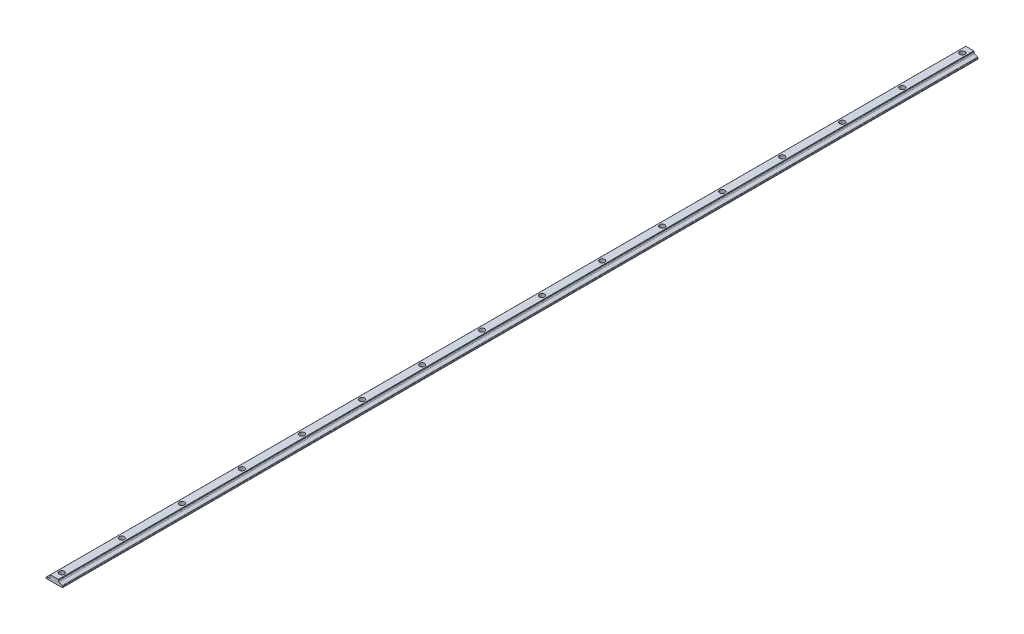
ISO-10303-21;
HEADER;
FILE_DESCRIPTION(('STEP AP214'),'2;1');
FILE_NAME('part.step','',(''),(''),'','','');
FILE_SCHEMA(('AUTOMOTIVE_DESIGN { 1 0 10303 214 1 1 1 1 }'));
ENDSEC;
DATA;
#1=APPLICATION_CONTEXT('core data for automotive mechanical design processes');
#2=APPLICATION_PROTOCOL_DEFINITION('international standard','automotive_design',2000,#1);
#3=PRODUCT_CONTEXT('',#1,'mechanical');
#4=PRODUCT('Part','Part','',(#3));
#5=PRODUCT_RELATED_PRODUCT_CATEGORY('part','',(#4));
#6=PRODUCT_DEFINITION_FORMATION('','',#4);
#7=PRODUCT_DEFINITION_CONTEXT('part definition',#1,'design');
#8=PRODUCT_DEFINITION('design','',#6,#7);
#9=PRODUCT_DEFINITION_SHAPE('','',#8);
#10=(LENGTH_UNIT() NAMED_UNIT(*) SI_UNIT(.MILLI.,.METRE.));
#11=(NAMED_UNIT(*) PLANE_ANGLE_UNIT() SI_UNIT($,.RADIAN.));
#12=(NAMED_UNIT(*) SI_UNIT($,.STERADIAN.) SOLID_ANGLE_UNIT());
#13=UNCERTAINTY_MEASURE_WITH_UNIT(LENGTH_MEASURE(1.E-05),#10,'distance_accuracy_value','');
#14=(GEOMETRIC_REPRESENTATION_CONTEXT(3) GLOBAL_UNCERTAINTY_ASSIGNED_CONTEXT((#13)) GLOBAL_UNIT_ASSIGNED_CONTEXT((#10,
#11,#12)) REPRESENTATION_CONTEXT('',''));
#15=CARTESIAN_POINT('',(0.,0.,0.));
#16=DIRECTION('',(0.,0.,1.));
#17=DIRECTION('',(1.,0.,0.));
#18=AXIS2_PLACEMENT_3D('',#15,#16,#17);
#19=CARTESIAN_POINT('',(5.43940049720106,-2.343999689794,387.35));
#20=DIRECTION('',(0.,0.,-1.));
#21=DIRECTION('',(-1.,0.,0.));
#22=AXIS2_PLACEMENT_3D('',#19,#20,#21);
#23=CYLINDRICAL_SURFACE('',#22,0.990000709201032);
#24=CARTESIAN_POINT('',(5.43940049720106,-2.343999689794,-387.35));
#25=DIRECTION('',(0.,0.,-1.));
#26=DIRECTION('',(1.,0.,0.));
#27=AXIS2_PLACEMENT_3D('',#24,#25,#26);
#28=CIRCLE('',#27,0.990000709201032);
#29=CARTESIAN_POINT('',(5.04570230438704,-3.25235156940537,-387.35));
#30=VERTEX_POINT('',#29);
#31=CARTESIAN_POINT('',(4.44939978800002,-2.343999689794,-387.35));
#32=VERTEX_POINT('',#31);
#33=EDGE_CURVE('E179',#30,#32,#28,.T.);
#34=ORIENTED_EDGE('',*,*,#33,.T.);
#35=DIRECTION('',(0.,0.,-1.));
#36=VECTOR('',#35,1.);
#37=CARTESIAN_POINT('',(4.44939978800002,-2.343999689794,387.35));
#38=LINE('',#37,#36);
#39=CARTESIAN_POINT('',(4.44939978800002,-2.343999689794,387.35));
#40=VERTEX_POINT('',#39);
#41=EDGE_CURVE('E247',#40,#32,#38,.T.);
#42=ORIENTED_EDGE('',*,*,#41,.F.);
#43=CARTESIAN_POINT('',(5.43940049720106,-2.343999689794,387.35));
#44=DIRECTION('',(0.,0.,-1.));
#45=DIRECTION('',(1.,0.,0.));
#46=AXIS2_PLACEMENT_3D('',#43,#44,#45);
#47=CIRCLE('',#46,0.990000709201032);
#48=CARTESIAN_POINT('',(5.04570230438704,-3.25235156940537,387.35));
#49=VERTEX_POINT('',#48);
#50=EDGE_CURVE('E210',#49,#40,#47,.T.);
#51=ORIENTED_EDGE('',*,*,#50,.F.);
#52=DIRECTION('',(0.,0.,-1.));
#53=VECTOR('',#52,1.);
#54=CARTESIAN_POINT('',(5.04570230438704,-3.25235156940537,387.35));
#55=LINE('',#54,#53);
#56=EDGE_CURVE('E175',#49,#30,#55,.T.);
#57=ORIENTED_EDGE('',*,*,#56,.T.);
#58=EDGE_LOOP('',(#34,#42,#51,#57));
#59=FACE_BOUND('',#58,.T.);
#60=ADVANCED_FACE('F33',(#59),#23,.F.);
#61=CARTESIAN_POINT('',(4.44939978800002,-2.343999689794,387.35));
#62=DIRECTION('',(-1.,0.,0.));
#63=DIRECTION('',(0.,-1.,0.));
#64=AXIS2_PLACEMENT_3D('',#61,#62,#63);
#65=PLANE('',#64);
#66=DIRECTION('',(0.,1.,0.));
#67=VECTOR('',#66,1.);
#68=CARTESIAN_POINT('',(4.44939978800002,-2.343999689794,-387.35));
#69=LINE('',#68,#67);
#70=CARTESIAN_POINT('',(4.44939978800002,-1.65400001896344,-387.35));
#71=VERTEX_POINT('',#70);
#72=EDGE_CURVE('E182',#32,#71,#69,.T.);
#73=ORIENTED_EDGE('',*,*,#72,.T.);
#74=DIRECTION('',(0.,0.,-1.));
#75=VECTOR('',#74,1.);
#76=CARTESIAN_POINT('',(4.44939978800002,-1.65400001896344,387.35));
#77=LINE('',#76,#75);
#78=CARTESIAN_POINT('',(4.44939978800002,-1.65400001896344,387.35));
#79=VERTEX_POINT('',#78);
#80=EDGE_CURVE('E244',#79,#71,#77,.T.);
#81=ORIENTED_EDGE('',*,*,#80,.F.);
#82=DIRECTION('',(0.,1.,0.));
#83=VECTOR('',#82,1.);
#84=CARTESIAN_POINT('',(4.44939978800002,-2.343999689794,387.35));
#85=LINE('',#84,#83);
#86=EDGE_CURVE('E118',#40,#79,#85,.T.);
#87=ORIENTED_EDGE('',*,*,#86,.F.);
#88=ORIENTED_EDGE('',*,*,#41,.T.);
#89=EDGE_LOOP('',(#73,#81,#87,#88));
#90=FACE_BOUND('',#89,.T.);
#91=ADVANCED_FACE('F349',(#90),#65,.F.);
#92=CARTESIAN_POINT('',(4.31939976903661,-1.65400001896344,387.35));
#93=DIRECTION('',(0.,0.,-1.));
#94=DIRECTION('',(-1.,0.,0.));
#95=AXIS2_PLACEMENT_3D('',#92,#93,#94);
#96=CYLINDRICAL_SURFACE('',#95,0.1300000189634);
#97=CARTESIAN_POINT('',(4.31939976903661,-1.65400001896344,-387.35));
#98=DIRECTION('',(0.,0.,1.));
#99=DIRECTION('',(1.,0.,0.));
#100=AXIS2_PLACEMENT_3D('',#97,#98,#99);
#101=CIRCLE('',#100,0.1300000189634);
#102=CARTESIAN_POINT('',(4.31939976903661,-1.52400000000004,-387.35));
#103=VERTEX_POINT('',#102);
#104=EDGE_CURVE('E185',#71,#103,#101,.T.);
#105=ORIENTED_EDGE('',*,*,#104,.T.);
#106=DIRECTION('',(0.,0.,-1.));
#107=VECTOR('',#106,1.);
#108=CARTESIAN_POINT('',(4.31939976903661,-1.52400000000004,387.35));
#109=LINE('',#108,#107);
#110=CARTESIAN_POINT('',(4.31939976903661,-1.52400000000004,387.35));
#111=VERTEX_POINT('',#110);
#112=EDGE_CURVE('E241',#111,#103,#109,.T.);
#113=ORIENTED_EDGE('',*,*,#112,.F.);
#114=CARTESIAN_POINT('',(4.31939976903661,-1.65400001896344,387.35));
#115=DIRECTION('',(0.,0.,1.));
#116=DIRECTION('',(1.,0.,0.));
#117=AXIS2_PLACEMENT_3D('',#114,#115,#116);
#118=CIRCLE('',#117,0.1300000189634);
#119=EDGE_CURVE('E666',#79,#111,#118,.T.);
#120=ORIENTED_EDGE('',*,*,#119,.F.);
#121=ORIENTED_EDGE('',*,*,#80,.T.);
#122=EDGE_LOOP('',(#105,#113,#120,#121));
#123=FACE_BOUND('',#122,.T.);
#124=ADVANCED_FACE('F339',(#123),#96,.T.);
#125=CARTESIAN_POINT('',(4.31939976903661,-1.52400000000004,387.35));
#126=DIRECTION('',(0.,-1.,0.));
#127=DIRECTION('',(1.,0.,0.));
#128=AXIS2_PLACEMENT_3D('',#125,#126,#127);
#129=PLANE('',#128);
#130=CARTESIAN_POINT('',(0.965200000000012,-1.52400000000003,330.2));
#131=DIRECTION('',(0.,1.,0.));
#132=DIRECTION('',(-1.,0.,0.));
#133=AXIS2_PLACEMENT_3D('',#130,#131,#132);
#134=CIRCLE('',#133,2.18440000000002);
#135=CARTESIAN_POINT('',(-1.21920000000001,-1.52400000000002,330.2));
#136=VERTEX_POINT('',#135);
#137=EDGE_CURVE('E655',#136,#136,#134,.T.);
#138=ORIENTED_EDGE('',*,*,#137,.F.);
#139=EDGE_LOOP('',(#138));
#140=FACE_BOUND('',#139,.T.);
#141=CARTESIAN_POINT('',(0.965200000000012,-1.52400000000003,381.));
#142=DIRECTION('',(0.,1.,0.));
#143=DIRECTION('',(-1.,0.,0.));
#144=AXIS2_PLACEMENT_3D('',#141,#142,#143);
#145=CIRCLE('',#144,2.18440000000002);
#146=CARTESIAN_POINT('',(-1.21920000000001,-1.52400000000002,381.));
#147=VERTEX_POINT('',#146);
#148=EDGE_CURVE('E656',#147,#147,#145,.T.);
#149=ORIENTED_EDGE('',*,*,#148,.F.);
#150=EDGE_LOOP('',(#149));
#151=FACE_BOUND('',#150,.T.);
#152=DIRECTION('',(-1.,0.,0.));
#153=VECTOR('',#152,1.);
#154=CARTESIAN_POINT('',(4.31939976903661,-1.52400000000004,-387.35));
#155=LINE('',#154,#153);
#156=CARTESIAN_POINT('',(-2.38060024303659,-1.52400000000001,-387.35));
#157=VERTEX_POINT('',#156);
#158=EDGE_CURVE('E187',#103,#157,#155,.T.);
#159=ORIENTED_EDGE('',*,*,#158,.T.);
#160=DIRECTION('',(0.,0.,-1.));
#161=VECTOR('',#160,1.);
#162=CARTESIAN_POINT('',(-2.38060024303659,-1.52400000000001,387.35));
#163=LINE('',#162,#161);
#164=CARTESIAN_POINT('',(-2.38060024303659,-1.52400000000001,387.35));
#165=VERTEX_POINT('',#164);
#166=EDGE_CURVE('E238',#165,#157,#163,.T.);
#167=ORIENTED_EDGE('',*,*,#166,.F.);
#168=DIRECTION('',(-1.,0.,0.));
#169=VECTOR('',#168,1.);
#170=CARTESIAN_POINT('',(4.31939976903661,-1.52400000000004,387.35));
#171=LINE('',#170,#169);
#172=EDGE_CURVE('E668',#111,#165,#171,.T.);
#173=ORIENTED_EDGE('',*,*,#172,.F.);
#174=ORIENTED_EDGE('',*,*,#112,.T.);
#175=EDGE_LOOP('',(#159,#167,#173,#174));
#176=FACE_BOUND('',#175,.T.);
#177=CARTESIAN_POINT('',(0.965200000000012,-1.52400000000003,279.4));
#178=DIRECTION('',(0.,1.,0.));
#179=DIRECTION('',(-1.,0.,0.));
#180=AXIS2_PLACEMENT_3D('',#177,#178,#179);
#181=CIRCLE('',#180,2.18440000000002);
#182=CARTESIAN_POINT('',(-1.21920000000001,-1.52400000000002,279.4));
#183=VERTEX_POINT('',#182);
#184=EDGE_CURVE('E252',#183,#183,#181,.T.);
#185=ORIENTED_EDGE('',*,*,#184,.F.);
#186=EDGE_LOOP('',(#185));
#187=FACE_BOUND('',#186,.T.);
#188=CARTESIAN_POINT('',(0.965200000000012,-1.52400000000003,228.6));
#189=DIRECTION('',(0.,1.,0.));
#190=DIRECTION('',(-1.,0.,0.));
#191=AXIS2_PLACEMENT_3D('',#188,#189,#190);
#192=CIRCLE('',#191,2.18440000000002);
#193=CARTESIAN_POINT('',(-1.21920000000001,-1.52400000000002,228.6));
#194=VERTEX_POINT('',#193);
#195=EDGE_CURVE('E258',#194,#194,#192,.T.);
#196=ORIENTED_EDGE('',*,*,#195,.F.);
#197=EDGE_LOOP('',(#196));
#198=FACE_BOUND('',#197,.T.);
#199=CARTESIAN_POINT('',(0.965200000000012,-1.52400000000003,177.8));
#200=DIRECTION('',(0.,1.,0.));
#201=DIRECTION('',(-1.,0.,0.));
#202=AXIS2_PLACEMENT_3D('',#199,#200,#201);
#203=CIRCLE('',#202,2.18440000000002);
#204=CARTESIAN_POINT('',(-1.21920000000001,-1.52400000000002,177.8));
#205=VERTEX_POINT('',#204);
#206=EDGE_CURVE('E264',#205,#205,#203,.T.);
#207=ORIENTED_EDGE('',*,*,#206,.F.);
#208=EDGE_LOOP('',(#207));
#209=FACE_BOUND('',#208,.T.);
#210=CARTESIAN_POINT('',(0.965200000000012,-1.52400000000003,127.));
#211=DIRECTION('',(0.,1.,0.));
#212=DIRECTION('',(-1.,0.,0.));
#213=AXIS2_PLACEMENT_3D('',#210,#211,#212);
#214=CIRCLE('',#213,2.18440000000002);
#215=CARTESIAN_POINT('',(-1.21920000000001,-1.52400000000002,127.));
#216=VERTEX_POINT('',#215);
#217=EDGE_CURVE('E270',#216,#216,#214,.T.);
#218=ORIENTED_EDGE('',*,*,#217,.F.);
#219=EDGE_LOOP('',(#218));
#220=FACE_BOUND('',#219,.T.);
#221=CARTESIAN_POINT('',(0.965200000000012,-1.52400000000003,76.2));
#222=DIRECTION('',(0.,1.,0.));
#223=DIRECTION('',(-1.,0.,0.));
#224=AXIS2_PLACEMENT_3D('',#221,#222,#223);
#225=CIRCLE('',#224,2.18440000000002);
#226=CARTESIAN_POINT('',(-1.21920000000001,-1.52400000000002,76.2));
#227=VERTEX_POINT('',#226);
#228=EDGE_CURVE('E276',#227,#227,#225,.T.);
#229=ORIENTED_EDGE('',*,*,#228,.F.);
#230=EDGE_LOOP('',(#229));
#231=FACE_BOUND('',#230,.T.);
#232=CARTESIAN_POINT('',(0.965200000000012,-1.52400000000003,25.4));
#233=DIRECTION('',(0.,1.,0.));
#234=DIRECTION('',(-1.,0.,0.));
#235=AXIS2_PLACEMENT_3D('',#232,#233,#234);
#236=CIRCLE('',#235,2.18440000000002);
#237=CARTESIAN_POINT('',(-1.21920000000001,-1.52400000000002,25.4));
#238=VERTEX_POINT('',#237);
#239=EDGE_CURVE('E282',#238,#238,#236,.T.);
#240=ORIENTED_EDGE('',*,*,#239,.F.);
#241=EDGE_LOOP('',(#240));
#242=FACE_BOUND('',#241,.T.);
#243=CARTESIAN_POINT('',(0.965200000000012,-1.52400000000003,-25.4));
#244=DIRECTION('',(0.,1.,0.));
#245=DIRECTION('',(-1.,0.,0.));
#246=AXIS2_PLACEMENT_3D('',#243,#244,#245);
#247=CIRCLE('',#246,2.18440000000002);
#248=CARTESIAN_POINT('',(-1.21920000000001,-1.52400000000002,-25.4));
#249=VERTEX_POINT('',#248);
#250=EDGE_CURVE('E288',#249,#249,#247,.T.);
#251=ORIENTED_EDGE('',*,*,#250,.F.);
#252=EDGE_LOOP('',(#251));
#253=FACE_BOUND('',#252,.T.);
#254=CARTESIAN_POINT('',(0.965200000000012,-1.52400000000003,-76.2));
#255=DIRECTION('',(0.,1.,0.));
#256=DIRECTION('',(-1.,0.,0.));
#257=AXIS2_PLACEMENT_3D('',#254,#255,#256);
#258=CIRCLE('',#257,2.18440000000002);
#259=CARTESIAN_POINT('',(-1.21920000000001,-1.52400000000002,-76.2));
#260=VERTEX_POINT('',#259);
#261=EDGE_CURVE('E294',#260,#260,#258,.T.);
#262=ORIENTED_EDGE('',*,*,#261,.F.);
#263=EDGE_LOOP('',(#262));
#264=FACE_BOUND('',#263,.T.);
#265=CARTESIAN_POINT('',(0.965200000000012,-1.52400000000003,-127.));
#266=DIRECTION('',(0.,1.,0.));
#267=DIRECTION('',(-1.,0.,0.));
#268=AXIS2_PLACEMENT_3D('',#265,#266,#267);
#269=CIRCLE('',#268,2.18440000000002);
#270=CARTESIAN_POINT('',(-1.21920000000001,-1.52400000000002,-127.));
#271=VERTEX_POINT('',#270);
#272=EDGE_CURVE('E300',#271,#271,#269,.T.);
#273=ORIENTED_EDGE('',*,*,#272,.F.);
#274=EDGE_LOOP('',(#273));
#275=FACE_BOUND('',#274,.T.);
#276=CARTESIAN_POINT('',(0.965200000000012,-1.52400000000003,-177.8));
#277=DIRECTION('',(0.,1.,0.));
#278=DIRECTION('',(-1.,0.,0.));
#279=AXIS2_PLACEMENT_3D('',#276,#277,#278);
#280=CIRCLE('',#279,2.18440000000002);
#281=CARTESIAN_POINT('',(-1.21920000000001,-1.52400000000002,-177.8));
#282=VERTEX_POINT('',#281);
#283=EDGE_CURVE('E306',#282,#282,#280,.T.);
#284=ORIENTED_EDGE('',*,*,#283,.F.);
#285=EDGE_LOOP('',(#284));
#286=FACE_BOUND('',#285,.T.);
#287=CARTESIAN_POINT('',(0.965200000000012,-1.52400000000003,-228.6));
#288=DIRECTION('',(0.,1.,0.));
#289=DIRECTION('',(-1.,0.,0.));
#290=AXIS2_PLACEMENT_3D('',#287,#288,#289);
#291=CIRCLE('',#290,2.18440000000002);
#292=CARTESIAN_POINT('',(-1.21920000000001,-1.52400000000002,-228.6));
#293=VERTEX_POINT('',#292);
#294=EDGE_CURVE('E312',#293,#293,#291,.T.);
#295=ORIENTED_EDGE('',*,*,#294,.F.);
#296=EDGE_LOOP('',(#295));
#297=FACE_BOUND('',#296,.T.);
#298=CARTESIAN_POINT('',(0.965200000000012,-1.52400000000003,-279.4));
#299=DIRECTION('',(0.,1.,0.));
#300=DIRECTION('',(-1.,0.,0.));
#301=AXIS2_PLACEMENT_3D('',#298,#299,#300);
#302=CIRCLE('',#301,2.18440000000002);
#303=CARTESIAN_POINT('',(-1.21920000000001,-1.52400000000002,-279.4));
#304=VERTEX_POINT('',#303);
#305=EDGE_CURVE('E318',#304,#304,#302,.T.);
#306=ORIENTED_EDGE('',*,*,#305,.F.);
#307=EDGE_LOOP('',(#306));
#308=FACE_BOUND('',#307,.T.);
#309=CARTESIAN_POINT('',(0.965200000000012,-1.52400000000003,-330.2));
#310=DIRECTION('',(0.,1.,0.));
#311=DIRECTION('',(-1.,0.,0.));
#312=AXIS2_PLACEMENT_3D('',#309,#310,#311);
#313=CIRCLE('',#312,2.18440000000002);
#314=CARTESIAN_POINT('',(-1.21920000000001,-1.52400000000002,-330.2));
#315=VERTEX_POINT('',#314);
#316=EDGE_CURVE('E324',#315,#315,#313,.T.);
#317=ORIENTED_EDGE('',*,*,#316,.F.);
#318=EDGE_LOOP('',(#317));
#319=FACE_BOUND('',#318,.T.);
#320=CARTESIAN_POINT('',(0.965200000000012,-1.52400000000003,-381.));
#321=DIRECTION('',(0.,1.,0.));
#322=DIRECTION('',(-1.,0.,0.));
#323=AXIS2_PLACEMENT_3D('',#320,#321,#322);
#324=CIRCLE('',#323,2.18440000000002);
#325=CARTESIAN_POINT('',(-1.21920000000001,-1.52400000000002,-381.));
#326=VERTEX_POINT('',#325);
#327=EDGE_CURVE('E11',#326,#326,#324,.T.);
#328=ORIENTED_EDGE('',*,*,#327,.F.);
#329=EDGE_LOOP('',(#328));
#330=FACE_BOUND('',#329,.T.);
#331=ADVANCED_FACE('F336',(#140,#151,#176,#187,#198,#209,#220,#231,#242,#253,#264,#275,#286,
#297,#308,#319,#330),#129,.F.);
#332=CARTESIAN_POINT('',(-2.38060024303659,-1.65400001896341,387.35));
#333=DIRECTION('',(0.,0.,-1.));
#334=DIRECTION('',(-1.,0.,0.));
#335=AXIS2_PLACEMENT_3D('',#332,#333,#334);
#336=CYLINDRICAL_SURFACE('',#335,0.1300000189634);
#337=CARTESIAN_POINT('',(-2.38060024303659,-1.65400001896341,-387.35));
#338=DIRECTION('',(0.,0.,1.));
#339=DIRECTION('',(1.,0.,0.));
#340=AXIS2_PLACEMENT_3D('',#337,#338,#339);
#341=CIRCLE('',#340,0.1300000189634);
#342=CARTESIAN_POINT('',(-2.51060026199999,-1.65400001896341,-387.35));
#343=VERTEX_POINT('',#342);
#344=EDGE_CURVE('E189',#157,#343,#341,.T.);
#345=ORIENTED_EDGE('',*,*,#344,.T.);
#346=DIRECTION('',(0.,0.,-1.));
#347=VECTOR('',#346,1.);
#348=CARTESIAN_POINT('',(-2.51060026199999,-1.65400001896341,387.35));
#349=LINE('',#348,#347);
#350=CARTESIAN_POINT('',(-2.51060026199999,-1.65400001896341,387.35));
#351=VERTEX_POINT('',#350);
#352=EDGE_CURVE('E235',#351,#343,#349,.T.);
#353=ORIENTED_EDGE('',*,*,#352,.F.);
#354=CARTESIAN_POINT('',(-2.38060024303659,-1.65400001896341,387.35));
#355=DIRECTION('',(0.,0.,1.));
#356=DIRECTION('',(1.,0.,0.));
#357=AXIS2_PLACEMENT_3D('',#354,#355,#356);
#358=CIRCLE('',#357,0.1300000189634);
#359=EDGE_CURVE('E670',#165,#351,#358,.T.);
#360=ORIENTED_EDGE('',*,*,#359,.F.);
#361=ORIENTED_EDGE('',*,*,#166,.T.);
#362=EDGE_LOOP('',(#345,#353,#360,#361));
#363=FACE_BOUND('',#362,.T.);
#364=ADVANCED_FACE('F338',(#363),#336,.T.);
#365=CARTESIAN_POINT('',(-2.51060026199999,-1.65400001896341,387.35));
#366=DIRECTION('',(1.,0.,0.));
#367=DIRECTION('',(0.,1.,0.));
#368=AXIS2_PLACEMENT_3D('',#365,#366,#367);
#369=PLANE('',#368);
#370=DIRECTION('',(0.,-1.,0.));
#371=VECTOR('',#370,1.);
#372=CARTESIAN_POINT('',(-2.51060026199999,-1.65400001896341,-387.35));
#373=LINE('',#372,#371);
#374=CARTESIAN_POINT('',(-2.51060026199999,-3.25400007569487,-387.35));
#375=VERTEX_POINT('',#374);
#376=EDGE_CURVE('E191',#343,#375,#373,.T.);
#377=ORIENTED_EDGE('',*,*,#376,.T.);
#378=DIRECTION('',(0.,0.,-1.));
#379=VECTOR('',#378,1.);
#380=CARTESIAN_POINT('',(-2.51060026199999,-3.25400007569487,387.35));
#381=LINE('',#380,#379);
#382=CARTESIAN_POINT('',(-2.51060026199999,-3.25400007569487,387.35));
#383=VERTEX_POINT('',#382);
#384=EDGE_CURVE('E232',#383,#375,#381,.T.);
#385=ORIENTED_EDGE('',*,*,#384,.F.);
#386=DIRECTION('',(0.,-1.,0.));
#387=VECTOR('',#386,1.);
#388=CARTESIAN_POINT('',(-2.51060026199999,-1.65400001896341,387.35));
#389=LINE('',#388,#387);
#390=EDGE_CURVE('E672',#351,#383,#389,.T.);
#391=ORIENTED_EDGE('',*,*,#390,.F.);
#392=ORIENTED_EDGE('',*,*,#352,.T.);
#393=EDGE_LOOP('',(#377,#385,#391,#392));
#394=FACE_BOUND('',#393,.T.);
#395=ADVANCED_FACE('F346',(#394),#369,.F.);
#396=CARTESIAN_POINT('',(-3.50060029669159,-3.25400007569487,387.35));
#397=DIRECTION('',(0.,0.,-1.));
#398=DIRECTION('',(-1.,0.,0.));
#399=AXIS2_PLACEMENT_3D('',#396,#397,#398);
#400=CYLINDRICAL_SURFACE('',#399,0.990000034691602);
#401=CARTESIAN_POINT('',(-3.50060029669159,-3.25400007569487,-387.35));
#402=DIRECTION('',(0.,0.,-1.));
#403=DIRECTION('',(1.,0.,0.));
#404=AXIS2_PLACEMENT_3D('',#401,#402,#403);
#405=CIRCLE('',#404,0.990000034691602);
#406=CARTESIAN_POINT('',(-3.23469184310814,-4.20762094532925,-387.35));
#407=VERTEX_POINT('',#406);
#408=EDGE_CURVE('E193',#375,#407,#405,.T.);
#409=ORIENTED_EDGE('',*,*,#408,.T.);
#410=DIRECTION('',(0.,0.,-1.));
#411=VECTOR('',#410,1.);
#412=CARTESIAN_POINT('',(-3.23469184310814,-4.20762094532925,387.35));
#413=LINE('',#412,#411);
#414=CARTESIAN_POINT('',(-3.23469184310814,-4.20762094532925,387.35));
#415=VERTEX_POINT('',#414);
#416=EDGE_CURVE('E229',#415,#407,#413,.T.);
#417=ORIENTED_EDGE('',*,*,#416,.F.);
#418=CARTESIAN_POINT('',(-3.50060029669159,-3.25400007569487,387.35));
#419=DIRECTION('',(0.,0.,-1.));
#420=DIRECTION('',(1.,0.,0.));
#421=AXIS2_PLACEMENT_3D('',#418,#419,#420);
#422=CIRCLE('',#421,0.990000034691602);
#423=EDGE_CURVE('E465',#383,#415,#422,.T.);
#424=ORIENTED_EDGE('',*,*,#423,.F.);
#425=ORIENTED_EDGE('',*,*,#384,.T.);
#426=EDGE_LOOP('',(#409,#417,#424,#425));
#427=FACE_BOUND('',#426,.T.);
#428=ADVANCED_FACE('F447',(#427),#400,.F.);
#429=CARTESIAN_POINT('',(-3.23469184310814,-4.20762094532924,387.35));
#430=DIRECTION('',(0.268594388146958,-0.963253369916743,0.));
#431=DIRECTION('',(0.963253369916743,0.268594388146958,0.));
#432=AXIS2_PLACEMENT_3D('',#429,#430,#431);
#433=PLANE('',#432);
#434=DIRECTION('',(-0.963253369916743,-0.268594388146958,0.));
#435=VECTOR('',#434,1.);
#436=CARTESIAN_POINT('',(-3.23469184310814,-4.20762094532924,-387.35));
#437=LINE('',#436,#435);
#438=CARTESIAN_POINT('',(-5.72758394715676,-4.90274109784031,-387.35));
#439=VERTEX_POINT('',#438);
#440=EDGE_CURVE('E195',#407,#439,#437,.T.);
#441=ORIENTED_EDGE('',*,*,#440,.T.);
#442=DIRECTION('',(0.,0.,-1.));
#443=VECTOR('',#442,1.);
#444=CARTESIAN_POINT('',(-5.72758394715676,-4.90274109784031,387.35));
#445=LINE('',#444,#443);
#446=CARTESIAN_POINT('',(-5.72758394715676,-4.90274109784031,387.35));
#447=VERTEX_POINT('',#446);
#448=EDGE_CURVE('E226',#447,#439,#445,.T.);
#449=ORIENTED_EDGE('',*,*,#448,.F.);
#450=DIRECTION('',(-0.963253369916743,-0.268594388146958,0.));
#451=VECTOR('',#450,1.);
#452=CARTESIAN_POINT('',(-3.23469184310814,-4.20762094532924,387.35));
#453=LINE('',#452,#451);
#454=EDGE_CURVE('E478',#415,#447,#453,.T.);
#455=ORIENTED_EDGE('',*,*,#454,.F.);
#456=ORIENTED_EDGE('',*,*,#416,.T.);
#457=EDGE_LOOP('',(#441,#449,#455,#456));
#458=FACE_BOUND('',#457,.T.);
#459=ADVANCED_FACE('F443',(#458),#433,.F.);
#460=CARTESIAN_POINT('',(-5.59060094184606,-5.39399984079897,387.35));
#461=DIRECTION('',(0.,0.,-1.));
#462=DIRECTION('',(-1.,0.,0.));
#463=AXIS2_PLACEMENT_3D('',#460,#461,#462);
#464=CYLINDRICAL_SURFACE('',#463,0.509999506153944);
#465=CARTESIAN_POINT('',(-5.59060094184606,-5.39399984079897,-387.35));
#466=DIRECTION('',(0.,0.,1.));
#467=DIRECTION('',(1.,0.,0.));
#468=AXIS2_PLACEMENT_3D('',#465,#466,#467);
#469=CIRCLE('',#468,0.509999506153944);
#470=CARTESIAN_POINT('',(-6.100600448,-5.39399984079897,-387.35));
#471=VERTEX_POINT('',#470);
#472=EDGE_CURVE('E197',#439,#471,#469,.T.);
#473=ORIENTED_EDGE('',*,*,#472,.T.);
#474=DIRECTION('',(0.,0.,-1.));
#475=VECTOR('',#474,1.);
#476=CARTESIAN_POINT('',(-6.100600448,-5.39399984079897,387.35));
#477=LINE('',#476,#475);
#478=CARTESIAN_POINT('',(-6.100600448,-5.39399984079897,387.35));
#479=VERTEX_POINT('',#478);
#480=EDGE_CURVE('E223',#479,#471,#477,.T.);
#481=ORIENTED_EDGE('',*,*,#480,.F.);
#482=CARTESIAN_POINT('',(-5.59060094184606,-5.39399984079897,387.35));
#483=DIRECTION('',(0.,0.,1.));
#484=DIRECTION('',(1.,0.,0.));
#485=AXIS2_PLACEMENT_3D('',#482,#483,#484);
#486=CIRCLE('',#485,0.509999506153944);
#487=EDGE_CURVE('E475',#447,#479,#486,.T.);
#488=ORIENTED_EDGE('',*,*,#487,.F.);
#489=ORIENTED_EDGE('',*,*,#448,.T.);
#490=EDGE_LOOP('',(#473,#481,#488,#489));
#491=FACE_BOUND('',#490,.T.);
#492=ADVANCED_FACE('F439',(#491),#464,.T.);
#493=CARTESIAN_POINT('',(-6.100600448,-5.39399984079897,387.35));
#494=DIRECTION('',(1.,0.,0.));
#495=DIRECTION('',(0.,0.,-1.));
#496=AXIS2_PLACEMENT_3D('',#493,#494,#495);
#497=PLANE('',#496);
#498=DIRECTION('',(0.,-1.,0.));
#499=VECTOR('',#498,1.);
#500=CARTESIAN_POINT('',(-6.100600448,-5.39399984079897,-387.35));
#501=LINE('',#500,#499);
#502=CARTESIAN_POINT('',(-6.100600448,-5.74399996740618,-387.35));
#503=VERTEX_POINT('',#502);
#504=EDGE_CURVE('E199',#471,#503,#501,.T.);
#505=ORIENTED_EDGE('',*,*,#504,.T.);
#506=DIRECTION('',(0.,0.,-1.));
#507=VECTOR('',#506,1.);
#508=CARTESIAN_POINT('',(-6.100600448,-5.74399996740618,387.35));
#509=LINE('',#508,#507);
#510=CARTESIAN_POINT('',(-6.100600448,-5.74399996740618,387.35));
#511=VERTEX_POINT('',#510);
#512=EDGE_CURVE('E220',#511,#503,#509,.T.);
#513=ORIENTED_EDGE('',*,*,#512,.F.);
#514=DIRECTION('',(0.,-1.,0.));
#515=VECTOR('',#514,1.);
#516=CARTESIAN_POINT('',(-6.100600448,-5.39399984079897,387.35));
#517=LINE('',#516,#515);
#518=EDGE_CURVE('E477',#479,#511,#517,.T.);
#519=ORIENTED_EDGE('',*,*,#518,.F.);
#520=ORIENTED_EDGE('',*,*,#480,.T.);
#521=EDGE_LOOP('',(#505,#513,#519,#520));
#522=FACE_BOUND('',#521,.T.);
#523=ADVANCED_FACE('F430',(#522),#497,.F.);
#524=CARTESIAN_POINT('',(-5.85060021140612,-5.74399996740612,387.35));
#525=DIRECTION('',(0.,0.,-1.));
#526=DIRECTION('',(-1.,0.,0.));
#527=AXIS2_PLACEMENT_3D('',#524,#525,#526);
#528=CYLINDRICAL_SURFACE('',#527,0.250000236593877);
#529=CARTESIAN_POINT('',(-5.85060021140612,-5.74399996740612,-387.35));
#530=DIRECTION('',(0.,0.,1.));
#531=DIRECTION('',(1.,0.,0.));
#532=AXIS2_PLACEMENT_3D('',#529,#530,#531);
#533=CIRCLE('',#532,0.250000236593877);
#534=CARTESIAN_POINT('',(-5.85060021140613,-5.994000204,-387.35));
#535=VERTEX_POINT('',#534);
#536=EDGE_CURVE('E201',#503,#535,#533,.T.);
#537=ORIENTED_EDGE('',*,*,#536,.T.);
#538=DIRECTION('',(0.,0.,-1.));
#539=VECTOR('',#538,1.);
#540=CARTESIAN_POINT('',(-5.85060021140613,-5.994000204,387.35));
#541=LINE('',#540,#539);
#542=CARTESIAN_POINT('',(-5.85060021140613,-5.994000204,387.35));
#543=VERTEX_POINT('',#542);
#544=EDGE_CURVE('E217',#543,#535,#541,.T.);
#545=ORIENTED_EDGE('',*,*,#544,.F.);
#546=CARTESIAN_POINT('',(-5.85060021140612,-5.74399996740612,387.35));
#547=DIRECTION('',(0.,0.,1.));
#548=DIRECTION('',(1.,0.,0.));
#549=AXIS2_PLACEMENT_3D('',#546,#547,#548);
#550=CIRCLE('',#549,0.250000236593877);
#551=EDGE_CURVE('E480',#511,#543,#550,.T.);
#552=ORIENTED_EDGE('',*,*,#551,.F.);
#553=ORIENTED_EDGE('',*,*,#512,.T.);
#554=EDGE_LOOP('',(#537,#545,#552,#553));
#555=FACE_BOUND('',#554,.T.);
#556=ADVANCED_FACE('F421',(#555),#528,.T.);
#557=CARTESIAN_POINT('',(-5.85060021140613,-5.994000204,387.35));
#558=DIRECTION('',(0.,1.,0.));
#559=DIRECTION('',(-1.,0.,0.));
#560=AXIS2_PLACEMENT_3D('',#557,#558,#559);
#561=PLANE('',#560);
#562=CARTESIAN_POINT('',(0.965199999999996,-5.99400020400008,330.2));
#563=DIRECTION('',(0.,1.,0.));
#564=DIRECTION('',(-1.,0.,0.));
#565=AXIS2_PLACEMENT_3D('',#562,#563,#564);
#566=CIRCLE('',#565,2.18440000000002);
#567=CARTESIAN_POINT('',(-1.21920000000002,-5.99400020400007,330.2));
#568=VERTEX_POINT('',#567);
#569=EDGE_CURVE('E653',#568,#568,#566,.T.);
#570=ORIENTED_EDGE('',*,*,#569,.T.);
#571=EDGE_LOOP('',(#570));
#572=FACE_BOUND('',#571,.T.);
#573=CARTESIAN_POINT('',(0.965199999999996,-5.99400020400008,381.));
#574=DIRECTION('',(0.,1.,0.));
#575=DIRECTION('',(-1.,0.,0.));
#576=AXIS2_PLACEMENT_3D('',#573,#574,#575);
#577=CIRCLE('',#576,2.18440000000002);
#578=CARTESIAN_POINT('',(-1.21920000000002,-5.99400020400007,381.));
#579=VERTEX_POINT('',#578);
#580=EDGE_CURVE('E183',#579,#579,#577,.T.);
#581=ORIENTED_EDGE('',*,*,#580,.T.);
#582=EDGE_LOOP('',(#581));
#583=FACE_BOUND('',#582,.T.);
#584=DIRECTION('',(1.,0.,0.));
#585=VECTOR('',#584,1.);
#586=CARTESIAN_POINT('',(-5.85060021140613,-5.994000204,-387.35));
#587=LINE('',#586,#585);
#588=CARTESIAN_POINT('',(7.64939976340617,-5.99400020400005,-387.35));
#589=VERTEX_POINT('',#588);
#590=EDGE_CURVE('E203',#535,#589,#587,.T.);
#591=ORIENTED_EDGE('',*,*,#590,.T.);
#592=DIRECTION('',(0.,0.,-1.));
#593=VECTOR('',#592,1.);
#594=CARTESIAN_POINT('',(7.64939976340617,-5.99400020400005,387.35));
#595=LINE('',#594,#593);
#596=CARTESIAN_POINT('',(7.64939976340617,-5.99400020400005,387.35));
#597=VERTEX_POINT('',#596);
#598=EDGE_CURVE('E214',#597,#589,#595,.T.);
#599=ORIENTED_EDGE('',*,*,#598,.F.);
#600=DIRECTION('',(1.,0.,0.));
#601=VECTOR('',#600,1.);
#602=CARTESIAN_POINT('',(-5.85060021140613,-5.994000204,387.35));
#603=LINE('',#602,#601);
#604=EDGE_CURVE('E486',#543,#597,#603,.T.);
#605=ORIENTED_EDGE('',*,*,#604,.F.);
#606=ORIENTED_EDGE('',*,*,#544,.T.);
#607=EDGE_LOOP('',(#591,#599,#605,#606));
#608=FACE_BOUND('',#607,.T.);
#609=CARTESIAN_POINT('',(0.965199999999996,-5.99400020400008,279.4));
#610=DIRECTION('',(0.,1.,0.));
#611=DIRECTION('',(-1.,0.,0.));
#612=AXIS2_PLACEMENT_3D('',#609,#610,#611);
#613=CIRCLE('',#612,2.18440000000002);
#614=CARTESIAN_POINT('',(-1.21920000000002,-5.99400020400007,279.4));
#615=VERTEX_POINT('',#614);
#616=EDGE_CURVE('E249',#615,#615,#613,.T.);
#617=ORIENTED_EDGE('',*,*,#616,.T.);
#618=EDGE_LOOP('',(#617));
#619=FACE_BOUND('',#618,.T.);
#620=CARTESIAN_POINT('',(0.965199999999996,-5.99400020400008,228.6));
#621=DIRECTION('',(0.,1.,0.));
#622=DIRECTION('',(-1.,0.,0.));
#623=AXIS2_PLACEMENT_3D('',#620,#621,#622);
#624=CIRCLE('',#623,2.18440000000002);
#625=CARTESIAN_POINT('',(-1.21920000000002,-5.99400020400007,228.6));
#626=VERTEX_POINT('',#625);
#627=EDGE_CURVE('E255',#626,#626,#624,.T.);
#628=ORIENTED_EDGE('',*,*,#627,.T.);
#629=EDGE_LOOP('',(#628));
#630=FACE_BOUND('',#629,.T.);
#631=CARTESIAN_POINT('',(0.965199999999996,-5.99400020400008,177.8));
#632=DIRECTION('',(0.,1.,0.));
#633=DIRECTION('',(-1.,0.,0.));
#634=AXIS2_PLACEMENT_3D('',#631,#632,#633);
#635=CIRCLE('',#634,2.18440000000002);
#636=CARTESIAN_POINT('',(-1.21920000000002,-5.99400020400007,177.8));
#637=VERTEX_POINT('',#636);
#638=EDGE_CURVE('E261',#637,#637,#635,.T.);
#639=ORIENTED_EDGE('',*,*,#638,.T.);
#640=EDGE_LOOP('',(#639));
#641=FACE_BOUND('',#640,.T.);
#642=CARTESIAN_POINT('',(0.965199999999996,-5.99400020400008,127.));
#643=DIRECTION('',(0.,1.,0.));
#644=DIRECTION('',(-1.,0.,0.));
#645=AXIS2_PLACEMENT_3D('',#642,#643,#644);
#646=CIRCLE('',#645,2.18440000000002);
#647=CARTESIAN_POINT('',(-1.21920000000002,-5.99400020400007,127.));
#648=VERTEX_POINT('',#647);
#649=EDGE_CURVE('E267',#648,#648,#646,.T.);
#650=ORIENTED_EDGE('',*,*,#649,.T.);
#651=EDGE_LOOP('',(#650));
#652=FACE_BOUND('',#651,.T.);
#653=CARTESIAN_POINT('',(0.965199999999996,-5.99400020400008,76.2));
#654=DIRECTION('',(0.,1.,0.));
#655=DIRECTION('',(-1.,0.,0.));
#656=AXIS2_PLACEMENT_3D('',#653,#654,#655);
#657=CIRCLE('',#656,2.18440000000002);
#658=CARTESIAN_POINT('',(-1.21920000000002,-5.99400020400007,76.2));
#659=VERTEX_POINT('',#658);
#660=EDGE_CURVE('E273',#659,#659,#657,.T.);
#661=ORIENTED_EDGE('',*,*,#660,.T.);
#662=EDGE_LOOP('',(#661));
#663=FACE_BOUND('',#662,.T.);
#664=CARTESIAN_POINT('',(0.965199999999996,-5.99400020400008,25.4));
#665=DIRECTION('',(0.,1.,0.));
#666=DIRECTION('',(-1.,0.,0.));
#667=AXIS2_PLACEMENT_3D('',#664,#665,#666);
#668=CIRCLE('',#667,2.18440000000002);
#669=CARTESIAN_POINT('',(-1.21920000000002,-5.99400020400007,25.4));
#670=VERTEX_POINT('',#669);
#671=EDGE_CURVE('E279',#670,#670,#668,.T.);
#672=ORIENTED_EDGE('',*,*,#671,.T.);
#673=EDGE_LOOP('',(#672));
#674=FACE_BOUND('',#673,.T.);
#675=CARTESIAN_POINT('',(0.965199999999996,-5.99400020400008,-25.4));
#676=DIRECTION('',(0.,1.,0.));
#677=DIRECTION('',(-1.,0.,0.));
#678=AXIS2_PLACEMENT_3D('',#675,#676,#677);
#679=CIRCLE('',#678,2.18440000000002);
#680=CARTESIAN_POINT('',(-1.21920000000002,-5.99400020400007,-25.4));
#681=VERTEX_POINT('',#680);
#682=EDGE_CURVE('E285',#681,#681,#679,.T.);
#683=ORIENTED_EDGE('',*,*,#682,.T.);
#684=EDGE_LOOP('',(#683));
#685=FACE_BOUND('',#684,.T.);
#686=CARTESIAN_POINT('',(0.965199999999996,-5.99400020400008,-76.2));
#687=DIRECTION('',(0.,1.,0.));
#688=DIRECTION('',(-1.,0.,0.));
#689=AXIS2_PLACEMENT_3D('',#686,#687,#688);
#690=CIRCLE('',#689,2.18440000000002);
#691=CARTESIAN_POINT('',(-1.21920000000002,-5.99400020400007,-76.2));
#692=VERTEX_POINT('',#691);
#693=EDGE_CURVE('E291',#692,#692,#690,.T.);
#694=ORIENTED_EDGE('',*,*,#693,.T.);
#695=EDGE_LOOP('',(#694));
#696=FACE_BOUND('',#695,.T.);
#697=CARTESIAN_POINT('',(0.965199999999996,-5.99400020400008,-127.));
#698=DIRECTION('',(0.,1.,0.));
#699=DIRECTION('',(-1.,0.,0.));
#700=AXIS2_PLACEMENT_3D('',#697,#698,#699);
#701=CIRCLE('',#700,2.18440000000002);
#702=CARTESIAN_POINT('',(-1.21920000000002,-5.99400020400007,-127.));
#703=VERTEX_POINT('',#702);
#704=EDGE_CURVE('E297',#703,#703,#701,.T.);
#705=ORIENTED_EDGE('',*,*,#704,.T.);
#706=EDGE_LOOP('',(#705));
#707=FACE_BOUND('',#706,.T.);
#708=CARTESIAN_POINT('',(0.965199999999996,-5.99400020400008,-177.8));
#709=DIRECTION('',(0.,1.,0.));
#710=DIRECTION('',(-1.,0.,0.));
#711=AXIS2_PLACEMENT_3D('',#708,#709,#710);
#712=CIRCLE('',#711,2.18440000000002);
#713=CARTESIAN_POINT('',(-1.21920000000002,-5.99400020400007,-177.8));
#714=VERTEX_POINT('',#713);
#715=EDGE_CURVE('E303',#714,#714,#712,.T.);
#716=ORIENTED_EDGE('',*,*,#715,.T.);
#717=EDGE_LOOP('',(#716));
#718=FACE_BOUND('',#717,.T.);
#719=CARTESIAN_POINT('',(0.965199999999996,-5.99400020400008,-228.6));
#720=DIRECTION('',(0.,1.,0.));
#721=DIRECTION('',(-1.,0.,0.));
#722=AXIS2_PLACEMENT_3D('',#719,#720,#721);
#723=CIRCLE('',#722,2.18440000000002);
#724=CARTESIAN_POINT('',(-1.21920000000002,-5.99400020400007,-228.6));
#725=VERTEX_POINT('',#724);
#726=EDGE_CURVE('E309',#725,#725,#723,.T.);
#727=ORIENTED_EDGE('',*,*,#726,.T.);
#728=EDGE_LOOP('',(#727));
#729=FACE_BOUND('',#728,.T.);
#730=CARTESIAN_POINT('',(0.965199999999996,-5.99400020400008,-279.4));
#731=DIRECTION('',(0.,1.,0.));
#732=DIRECTION('',(-1.,0.,0.));
#733=AXIS2_PLACEMENT_3D('',#730,#731,#732);
#734=CIRCLE('',#733,2.18440000000002);
#735=CARTESIAN_POINT('',(-1.21920000000002,-5.99400020400007,-279.4));
#736=VERTEX_POINT('',#735);
#737=EDGE_CURVE('E315',#736,#736,#734,.T.);
#738=ORIENTED_EDGE('',*,*,#737,.T.);
#739=EDGE_LOOP('',(#738));
#740=FACE_BOUND('',#739,.T.);
#741=CARTESIAN_POINT('',(0.965199999999996,-5.99400020400008,-330.2));
#742=DIRECTION('',(0.,1.,0.));
#743=DIRECTION('',(-1.,0.,0.));
#744=AXIS2_PLACEMENT_3D('',#741,#742,#743);
#745=CIRCLE('',#744,2.18440000000002);
#746=CARTESIAN_POINT('',(-1.21920000000002,-5.99400020400007,-330.2));
#747=VERTEX_POINT('',#746);
#748=EDGE_CURVE('E321',#747,#747,#745,.T.);
#749=ORIENTED_EDGE('',*,*,#748,.T.);
#750=EDGE_LOOP('',(#749));
#751=FACE_BOUND('',#750,.T.);
#752=CARTESIAN_POINT('',(0.965199999999996,-5.99400020400008,-381.));
#753=DIRECTION('',(0.,1.,0.));
#754=DIRECTION('',(-1.,0.,0.));
#755=AXIS2_PLACEMENT_3D('',#752,#753,#754);
#756=CIRCLE('',#755,2.18440000000002);
#757=CARTESIAN_POINT('',(-1.21920000000002,-5.99400020400007,-381.));
#758=VERTEX_POINT('',#757);
#759=EDGE_CURVE('E42',#758,#758,#756,.T.);
#760=ORIENTED_EDGE('',*,*,#759,.T.);
#761=EDGE_LOOP('',(#760));
#762=FACE_BOUND('',#761,.T.);
#763=ADVANCED_FACE('F329',(#572,#583,#608,#619,#630,#641,#652,#663,#674,#685,#696,#707,#718,
#729,#740,#751,#762),#561,.F.);
#764=CARTESIAN_POINT('',(7.64939976340612,-5.74399996740618,387.35));
#765=DIRECTION('',(0.,0.,-1.));
#766=DIRECTION('',(-1.,0.,0.));
#767=AXIS2_PLACEMENT_3D('',#764,#765,#766);
#768=CYLINDRICAL_SURFACE('',#767,0.250000236593875);
#769=CARTESIAN_POINT('',(7.64939976340612,-5.74399996740618,-387.35));
#770=DIRECTION('',(0.,0.,1.));
#771=DIRECTION('',(1.,0.,0.));
#772=AXIS2_PLACEMENT_3D('',#769,#770,#771);
#773=CIRCLE('',#772,0.250000236593875);
#774=CARTESIAN_POINT('',(7.8994,-5.74399996740618,-387.35));
#775=VERTEX_POINT('',#774);
#776=EDGE_CURVE('E205',#589,#775,#773,.T.);
#777=ORIENTED_EDGE('',*,*,#776,.T.);
#778=DIRECTION('',(0.,0.,-1.));
#779=VECTOR('',#778,1.);
#780=CARTESIAN_POINT('',(7.8994,-5.74399996740618,387.35));
#781=LINE('',#780,#779);
#782=CARTESIAN_POINT('',(7.8994,-5.74399996740618,387.35));
#783=VERTEX_POINT('',#782);
#784=EDGE_CURVE('E170',#783,#775,#781,.T.);
#785=ORIENTED_EDGE('',*,*,#784,.F.);
#786=CARTESIAN_POINT('',(7.64939976340612,-5.74399996740618,387.35));
#787=DIRECTION('',(0.,0.,1.));
#788=DIRECTION('',(1.,0.,0.));
#789=AXIS2_PLACEMENT_3D('',#786,#787,#788);
#790=CIRCLE('',#789,0.250000236593875);
#791=EDGE_CURVE('E161',#597,#783,#790,.T.);
#792=ORIENTED_EDGE('',*,*,#791,.F.);
#793=ORIENTED_EDGE('',*,*,#598,.T.);
#794=EDGE_LOOP('',(#777,#785,#792,#793));
#795=FACE_BOUND('',#794,.T.);
#796=ADVANCED_FACE('F420',(#795),#768,.T.);
#797=CARTESIAN_POINT('',(7.8994,-5.74399996740618,387.35));
#798=DIRECTION('',(-1.,0.,0.));
#799=DIRECTION('',(0.,0.,1.));
#800=AXIS2_PLACEMENT_3D('',#797,#798,#799);
#801=PLANE('',#800);
#802=DIRECTION('',(0.,1.,0.));
#803=VECTOR('',#802,1.);
#804=CARTESIAN_POINT('',(7.8994,-5.74399996740618,-387.35));
#805=LINE('',#804,#803);
#806=CARTESIAN_POINT('',(7.8994,-4.82400048799305,-387.35));
#807=VERTEX_POINT('',#806);
#808=EDGE_CURVE('E169',#775,#807,#805,.T.);
#809=ORIENTED_EDGE('',*,*,#808,.T.);
#810=DIRECTION('',(0.,0.,-1.));
#811=VECTOR('',#810,1.);
#812=CARTESIAN_POINT('',(7.8994,-4.82400048799305,387.35));
#813=LINE('',#812,#811);
#814=CARTESIAN_POINT('',(7.8994,-4.82400048799305,387.35));
#815=VERTEX_POINT('',#814);
#816=EDGE_CURVE('E166',#815,#807,#813,.T.);
#817=ORIENTED_EDGE('',*,*,#816,.F.);
#818=DIRECTION('',(0.,1.,0.));
#819=VECTOR('',#818,1.);
#820=CARTESIAN_POINT('',(7.8994,-5.74399996740618,387.35));
#821=LINE('',#820,#819);
#822=EDGE_CURVE('E155',#783,#815,#821,.T.);
#823=ORIENTED_EDGE('',*,*,#822,.F.);
#824=ORIENTED_EDGE('',*,*,#784,.T.);
#825=EDGE_LOOP('',(#809,#817,#823,#824));
#826=FACE_BOUND('',#825,.T.);
#827=ADVANCED_FACE('F167',(#826),#801,.F.);
#828=CARTESIAN_POINT('',(7.38939942926493,-4.82400048799317,387.35));
#829=DIRECTION('',(0.,0.,-1.));
#830=DIRECTION('',(-1.,0.,0.));
#831=AXIS2_PLACEMENT_3D('',#828,#829,#830);
#832=CYLINDRICAL_SURFACE('',#831,0.510000570735071);
#833=CARTESIAN_POINT('',(7.38939942926493,-4.82400048799317,-387.35));
#834=DIRECTION('',(0.,0.,1.));
#835=DIRECTION('',(1.,0.,0.));
#836=AXIS2_PLACEMENT_3D('',#833,#834,#835);
#837=CIRCLE('',#836,0.510000570735071);
#838=CARTESIAN_POINT('',(7.59221373148349,-4.3560614524707,-387.35));
#839=VERTEX_POINT('',#838);
#840=EDGE_CURVE('E103',#807,#839,#837,.T.);
#841=ORIENTED_EDGE('',*,*,#840,.T.);
#842=DIRECTION('',(0.,0.,-1.));
#843=VECTOR('',#842,1.);
#844=CARTESIAN_POINT('',(7.59221373148349,-4.3560614524707,387.35));
#845=LINE('',#844,#843);
#846=CARTESIAN_POINT('',(7.59221373148349,-4.3560614524707,387.35));
#847=VERTEX_POINT('',#846);
#848=EDGE_CURVE('E171',#847,#839,#845,.T.);
#849=ORIENTED_EDGE('',*,*,#848,.F.);
#850=CARTESIAN_POINT('',(7.38939942926493,-4.82400048799317,387.35));
#851=DIRECTION('',(0.,0.,1.));
#852=DIRECTION('',(1.,0.,0.));
#853=AXIS2_PLACEMENT_3D('',#850,#851,#852);
#854=CIRCLE('',#853,0.510000570735071);
#855=EDGE_CURVE('E159',#815,#847,#854,.T.);
#856=ORIENTED_EDGE('',*,*,#855,.F.);
#857=ORIENTED_EDGE('',*,*,#816,.T.);
#858=EDGE_LOOP('',(#841,#849,#856,#857));
#859=FACE_BOUND('',#858,.T.);
#860=ADVANCED_FACE('F173',(#859),#832,.T.);
#861=CARTESIAN_POINT('',(7.59221373148349,-4.3560614524707,387.35));
#862=DIRECTION('',(-0.397674657356279,-0.917526493839042,0.));
#863=DIRECTION('',(0.917526493839042,-0.397674657356279,0.));
#864=AXIS2_PLACEMENT_3D('',#861,#862,#863);
#865=PLANE('',#864);
#866=DIRECTION('',(-0.917526493839042,0.397674657356279,0.));
#867=VECTOR('',#866,1.);
#868=CARTESIAN_POINT('',(7.59221373148349,-4.3560614524707,-387.35));
#869=LINE('',#868,#867);
#870=EDGE_CURVE('E109',#839,#30,#869,.T.);
#871=ORIENTED_EDGE('',*,*,#870,.T.);
#872=ORIENTED_EDGE('',*,*,#56,.F.);
#873=DIRECTION('',(-0.917526493839042,0.397674657356279,0.));
#874=VECTOR('',#873,1.);
#875=CARTESIAN_POINT('',(7.59221373148349,-4.3560614524707,387.35));
#876=LINE('',#875,#874);
#877=EDGE_CURVE('E50',#847,#49,#876,.T.);
#878=ORIENTED_EDGE('',*,*,#877,.F.);
#879=ORIENTED_EDGE('',*,*,#848,.T.);
#880=EDGE_LOOP('',(#871,#872,#878,#879));
#881=FACE_BOUND('',#880,.T.);
#882=ADVANCED_FACE('F498',(#881),#865,.F.);
#883=CARTESIAN_POINT('',(5.43940049720106,-2.343999689794,387.35));
#884=DIRECTION('',(0.,0.,1.));
#885=DIRECTION('',(1.,0.,0.));
#886=AXIS2_PLACEMENT_3D('',#883,#884,#885);
#887=PLANE('',#886);
#888=ORIENTED_EDGE('',*,*,#50,.T.);
#889=ORIENTED_EDGE('',*,*,#86,.T.);
#890=ORIENTED_EDGE('',*,*,#119,.T.);
#891=ORIENTED_EDGE('',*,*,#172,.T.);
#892=ORIENTED_EDGE('',*,*,#359,.T.);
#893=ORIENTED_EDGE('',*,*,#390,.T.);
#894=ORIENTED_EDGE('',*,*,#423,.T.);
#895=ORIENTED_EDGE('',*,*,#454,.T.);
#896=ORIENTED_EDGE('',*,*,#487,.T.);
#897=ORIENTED_EDGE('',*,*,#518,.T.);
#898=ORIENTED_EDGE('',*,*,#551,.T.);
#899=ORIENTED_EDGE('',*,*,#604,.T.);
#900=ORIENTED_EDGE('',*,*,#791,.T.);
#901=ORIENTED_EDGE('',*,*,#822,.T.);
#902=ORIENTED_EDGE('',*,*,#855,.T.);
#903=ORIENTED_EDGE('',*,*,#877,.T.);
#904=EDGE_LOOP('',(#888,#889,#890,#891,#892,#893,#894,#895,#896,#897,#898,#899,#900,#901,#902,#903));
#905=FACE_BOUND('',#904,.T.);
#906=ADVANCED_FACE('F157',(#905),#887,.T.);
#907=CARTESIAN_POINT('',(5.43940049720106,-2.343999689794,-387.35));
#908=DIRECTION('',(0.,0.,1.));
#909=DIRECTION('',(1.,0.,0.));
#910=AXIS2_PLACEMENT_3D('',#907,#908,#909);
#911=PLANE('',#910);
#912=ORIENTED_EDGE('',*,*,#33,.F.);
#913=ORIENTED_EDGE('',*,*,#870,.F.);
#914=ORIENTED_EDGE('',*,*,#840,.F.);
#915=ORIENTED_EDGE('',*,*,#808,.F.);
#916=ORIENTED_EDGE('',*,*,#776,.F.);
#917=ORIENTED_EDGE('',*,*,#590,.F.);
#918=ORIENTED_EDGE('',*,*,#536,.F.);
#919=ORIENTED_EDGE('',*,*,#504,.F.);
#920=ORIENTED_EDGE('',*,*,#472,.F.);
#921=ORIENTED_EDGE('',*,*,#440,.F.);
#922=ORIENTED_EDGE('',*,*,#408,.F.);
#923=ORIENTED_EDGE('',*,*,#376,.F.);
#924=ORIENTED_EDGE('',*,*,#344,.F.);
#925=ORIENTED_EDGE('',*,*,#158,.F.);
#926=ORIENTED_EDGE('',*,*,#104,.F.);
#927=ORIENTED_EDGE('',*,*,#72,.F.);
#928=EDGE_LOOP('',(#912,#913,#914,#915,#916,#917,#918,#919,#920,#921,#922,#923,#924,#925,#926,#927));
#929=FACE_BOUND('',#928,.T.);
#930=ADVANCED_FACE('F468',(#929),#911,.F.);
#931=CARTESIAN_POINT('',(0.965199999999996,-5.99400020400008,381.));
#932=DIRECTION('',(0.,1.,0.));
#933=DIRECTION('',(-1.,0.,0.));
#934=AXIS2_PLACEMENT_3D('',#931,#932,#933);
#935=CYLINDRICAL_SURFACE('',#934,2.18440000000002);
#936=ORIENTED_EDGE('',*,*,#580,.F.);
#937=EDGE_LOOP('',(#936));
#938=FACE_BOUND('',#937,.T.);
#939=ORIENTED_EDGE('',*,*,#148,.T.);
#940=EDGE_LOOP('',(#939));
#941=FACE_BOUND('',#940,.T.);
#942=ADVANCED_FACE('F536',(#938,#941),#935,.F.);
#943=CARTESIAN_POINT('',(0.965199999999996,-5.99400020400008,330.2));
#944=DIRECTION('',(0.,1.,0.));
#945=DIRECTION('',(-1.,0.,0.));
#946=AXIS2_PLACEMENT_3D('',#943,#944,#945);
#947=CYLINDRICAL_SURFACE('',#946,2.18440000000002);
#948=ORIENTED_EDGE('',*,*,#569,.F.);
#949=EDGE_LOOP('',(#948));
#950=FACE_BOUND('',#949,.T.);
#951=ORIENTED_EDGE('',*,*,#137,.T.);
#952=EDGE_LOOP('',(#951));
#953=FACE_BOUND('',#952,.T.);
#954=ADVANCED_FACE('F366',(#950,#953),#947,.F.);
#955=CARTESIAN_POINT('',(0.965199999999996,-5.99400020400008,279.4));
#956=DIRECTION('',(0.,1.,0.));
#957=DIRECTION('',(-1.,0.,0.));
#958=AXIS2_PLACEMENT_3D('',#955,#956,#957);
#959=CYLINDRICAL_SURFACE('',#958,2.18440000000002);
#960=ORIENTED_EDGE('',*,*,#616,.F.);
#961=EDGE_LOOP('',(#960));
#962=FACE_BOUND('',#961,.T.);
#963=ORIENTED_EDGE('',*,*,#184,.T.);
#964=EDGE_LOOP('',(#963));
#965=FACE_BOUND('',#964,.T.);
#966=ADVANCED_FACE('F362',(#962,#965),#959,.F.);
#967=CARTESIAN_POINT('',(0.965199999999996,-5.99400020400008,228.6));
#968=DIRECTION('',(0.,1.,0.));
#969=DIRECTION('',(-1.,0.,0.));
#970=AXIS2_PLACEMENT_3D('',#967,#968,#969);
#971=CYLINDRICAL_SURFACE('',#970,2.18440000000002);
#972=ORIENTED_EDGE('',*,*,#627,.F.);
#973=EDGE_LOOP('',(#972));
#974=FACE_BOUND('',#973,.T.);
#975=ORIENTED_EDGE('',*,*,#195,.T.);
#976=EDGE_LOOP('',(#975));
#977=FACE_BOUND('',#976,.T.);
#978=ADVANCED_FACE('F365',(#974,#977),#971,.F.);
#979=CARTESIAN_POINT('',(0.965199999999996,-5.99400020400008,177.8));
#980=DIRECTION('',(0.,1.,0.));
#981=DIRECTION('',(-1.,0.,0.));
#982=AXIS2_PLACEMENT_3D('',#979,#980,#981);
#983=CYLINDRICAL_SURFACE('',#982,2.18440000000002);
#984=ORIENTED_EDGE('',*,*,#638,.F.);
#985=EDGE_LOOP('',(#984));
#986=FACE_BOUND('',#985,.T.);
#987=ORIENTED_EDGE('',*,*,#206,.T.);
#988=EDGE_LOOP('',(#987));
#989=FACE_BOUND('',#988,.T.);
#990=ADVANCED_FACE('F370',(#986,#989),#983,.F.);
#991=CARTESIAN_POINT('',(0.965199999999996,-5.99400020400008,127.));
#992=DIRECTION('',(0.,1.,0.));
#993=DIRECTION('',(-1.,0.,0.));
#994=AXIS2_PLACEMENT_3D('',#991,#992,#993);
#995=CYLINDRICAL_SURFACE('',#994,2.18440000000002);
#996=ORIENTED_EDGE('',*,*,#649,.F.);
#997=EDGE_LOOP('',(#996));
#998=FACE_BOUND('',#997,.T.);
#999=ORIENTED_EDGE('',*,*,#217,.T.);
#1000=EDGE_LOOP('',(#999));
#1001=FACE_BOUND('',#1000,.T.);
#1002=ADVANCED_FACE('F374',(#998,#1001),#995,.F.);
#1003=CARTESIAN_POINT('',(0.965199999999996,-5.99400020400008,76.2));
#1004=DIRECTION('',(0.,1.,0.));
#1005=DIRECTION('',(-1.,0.,0.));
#1006=AXIS2_PLACEMENT_3D('',#1003,#1004,#1005);
#1007=CYLINDRICAL_SURFACE('',#1006,2.18440000000002);
#1008=ORIENTED_EDGE('',*,*,#660,.F.);
#1009=EDGE_LOOP('',(#1008));
#1010=FACE_BOUND('',#1009,.T.);
#1011=ORIENTED_EDGE('',*,*,#228,.T.);
#1012=EDGE_LOOP('',(#1011));
#1013=FACE_BOUND('',#1012,.T.);
#1014=ADVANCED_FACE('F378',(#1010,#1013),#1007,.F.);
#1015=CARTESIAN_POINT('',(0.965199999999996,-5.99400020400008,25.4));
#1016=DIRECTION('',(0.,1.,0.));
#1017=DIRECTION('',(-1.,0.,0.));
#1018=AXIS2_PLACEMENT_3D('',#1015,#1016,#1017);
#1019=CYLINDRICAL_SURFACE('',#1018,2.18440000000002);
#1020=ORIENTED_EDGE('',*,*,#671,.F.);
#1021=EDGE_LOOP('',(#1020));
#1022=FACE_BOUND('',#1021,.T.);
#1023=ORIENTED_EDGE('',*,*,#239,.T.);
#1024=EDGE_LOOP('',(#1023));
#1025=FACE_BOUND('',#1024,.T.);
#1026=ADVANCED_FACE('F382',(#1022,#1025),#1019,.F.);
#1027=CARTESIAN_POINT('',(0.965199999999996,-5.99400020400008,-25.4));
#1028=DIRECTION('',(0.,1.,0.));
#1029=DIRECTION('',(-1.,0.,0.));
#1030=AXIS2_PLACEMENT_3D('',#1027,#1028,#1029);
#1031=CYLINDRICAL_SURFACE('',#1030,2.18440000000002);
#1032=ORIENTED_EDGE('',*,*,#682,.F.);
#1033=EDGE_LOOP('',(#1032));
#1034=FACE_BOUND('',#1033,.T.);
#1035=ORIENTED_EDGE('',*,*,#250,.T.);
#1036=EDGE_LOOP('',(#1035));
#1037=FACE_BOUND('',#1036,.T.);
#1038=ADVANCED_FACE('F386',(#1034,#1037),#1031,.F.);
#1039=CARTESIAN_POINT('',(0.965199999999996,-5.99400020400008,-76.2));
#1040=DIRECTION('',(0.,1.,0.));
#1041=DIRECTION('',(-1.,0.,0.));
#1042=AXIS2_PLACEMENT_3D('',#1039,#1040,#1041);
#1043=CYLINDRICAL_SURFACE('',#1042,2.18440000000002);
#1044=ORIENTED_EDGE('',*,*,#693,.F.);
#1045=EDGE_LOOP('',(#1044));
#1046=FACE_BOUND('',#1045,.T.);
#1047=ORIENTED_EDGE('',*,*,#261,.T.);
#1048=EDGE_LOOP('',(#1047));
#1049=FACE_BOUND('',#1048,.T.);
#1050=ADVANCED_FACE('F390',(#1046,#1049),#1043,.F.);
#1051=CARTESIAN_POINT('',(0.965199999999996,-5.99400020400008,-127.));
#1052=DIRECTION('',(0.,1.,0.));
#1053=DIRECTION('',(-1.,0.,0.));
#1054=AXIS2_PLACEMENT_3D('',#1051,#1052,#1053);
#1055=CYLINDRICAL_SURFACE('',#1054,2.18440000000002);
#1056=ORIENTED_EDGE('',*,*,#704,.F.);
#1057=EDGE_LOOP('',(#1056));
#1058=FACE_BOUND('',#1057,.T.);
#1059=ORIENTED_EDGE('',*,*,#272,.T.);
#1060=EDGE_LOOP('',(#1059));
#1061=FACE_BOUND('',#1060,.T.);
#1062=ADVANCED_FACE('F394',(#1058,#1061),#1055,.F.);
#1063=CARTESIAN_POINT('',(0.965199999999996,-5.99400020400008,-177.8));
#1064=DIRECTION('',(0.,1.,0.));
#1065=DIRECTION('',(-1.,0.,0.));
#1066=AXIS2_PLACEMENT_3D('',#1063,#1064,#1065);
#1067=CYLINDRICAL_SURFACE('',#1066,2.18440000000002);
#1068=ORIENTED_EDGE('',*,*,#715,.F.);
#1069=EDGE_LOOP('',(#1068));
#1070=FACE_BOUND('',#1069,.T.);
#1071=ORIENTED_EDGE('',*,*,#283,.T.);
#1072=EDGE_LOOP('',(#1071));
#1073=FACE_BOUND('',#1072,.T.);
#1074=ADVANCED_FACE('F398',(#1070,#1073),#1067,.F.);
#1075=CARTESIAN_POINT('',(0.965199999999996,-5.99400020400008,-228.6));
#1076=DIRECTION('',(0.,1.,0.));
#1077=DIRECTION('',(-1.,0.,0.));
#1078=AXIS2_PLACEMENT_3D('',#1075,#1076,#1077);
#1079=CYLINDRICAL_SURFACE('',#1078,2.18440000000002);
#1080=ORIENTED_EDGE('',*,*,#726,.F.);
#1081=EDGE_LOOP('',(#1080));
#1082=FACE_BOUND('',#1081,.T.);
#1083=ORIENTED_EDGE('',*,*,#294,.T.);
#1084=EDGE_LOOP('',(#1083));
#1085=FACE_BOUND('',#1084,.T.);
#1086=ADVANCED_FACE('F402',(#1082,#1085),#1079,.F.);
#1087=CARTESIAN_POINT('',(0.965199999999996,-5.99400020400008,-279.4));
#1088=DIRECTION('',(0.,1.,0.));
#1089=DIRECTION('',(-1.,0.,0.));
#1090=AXIS2_PLACEMENT_3D('',#1087,#1088,#1089);
#1091=CYLINDRICAL_SURFACE('',#1090,2.18440000000002);
#1092=ORIENTED_EDGE('',*,*,#737,.F.);
#1093=EDGE_LOOP('',(#1092));
#1094=FACE_BOUND('',#1093,.T.);
#1095=ORIENTED_EDGE('',*,*,#305,.T.);
#1096=EDGE_LOOP('',(#1095));
#1097=FACE_BOUND('',#1096,.T.);
#1098=ADVANCED_FACE('F406',(#1094,#1097),#1091,.F.);
#1099=CARTESIAN_POINT('',(0.965199999999996,-5.99400020400008,-330.2));
#1100=DIRECTION('',(0.,1.,0.));
#1101=DIRECTION('',(-1.,0.,0.));
#1102=AXIS2_PLACEMENT_3D('',#1099,#1100,#1101);
#1103=CYLINDRICAL_SURFACE('',#1102,2.18440000000002);
#1104=ORIENTED_EDGE('',*,*,#748,.F.);
#1105=EDGE_LOOP('',(#1104));
#1106=FACE_BOUND('',#1105,.T.);
#1107=ORIENTED_EDGE('',*,*,#316,.T.);
#1108=EDGE_LOOP('',(#1107));
#1109=FACE_BOUND('',#1108,.T.);
#1110=ADVANCED_FACE('F333',(#1106,#1109),#1103,.F.);
#1111=CARTESIAN_POINT('',(0.965199999999996,-5.99400020400008,-381.));
#1112=DIRECTION('',(0.,1.,0.));
#1113=DIRECTION('',(-1.,0.,0.));
#1114=AXIS2_PLACEMENT_3D('',#1111,#1112,#1113);
#1115=CYLINDRICAL_SURFACE('',#1114,2.18440000000002);
#1116=ORIENTED_EDGE('',*,*,#759,.F.);
#1117=EDGE_LOOP('',(#1116));
#1118=FACE_BOUND('',#1117,.T.);
#1119=ORIENTED_EDGE('',*,*,#327,.T.);
#1120=EDGE_LOOP('',(#1119));
#1121=FACE_BOUND('',#1120,.T.);
#1122=ADVANCED_FACE('F35',(#1118,#1121),#1115,.F.);
#1123=CLOSED_SHELL('',(#60,#91,#124,#331,#364,#395,#428,#459,#492,#523,#556,#763,#796,#827,#860,
#882,#906,#930,#942,#954,#966,#978,#990,#1002,#1014,#1026,#1038,#1050,#1062,#1074,#1086,#1098,
#1110,#1122));
#1124=MANIFOLD_SOLID_BREP('B2',#1123);
#1125=ADVANCED_BREP_SHAPE_REPRESENTATION('',(#18,#1124),#14);
#1126=SHAPE_DEFINITION_REPRESENTATION(#9,#1125);
ENDSEC;
END-ISO-10303-21;
